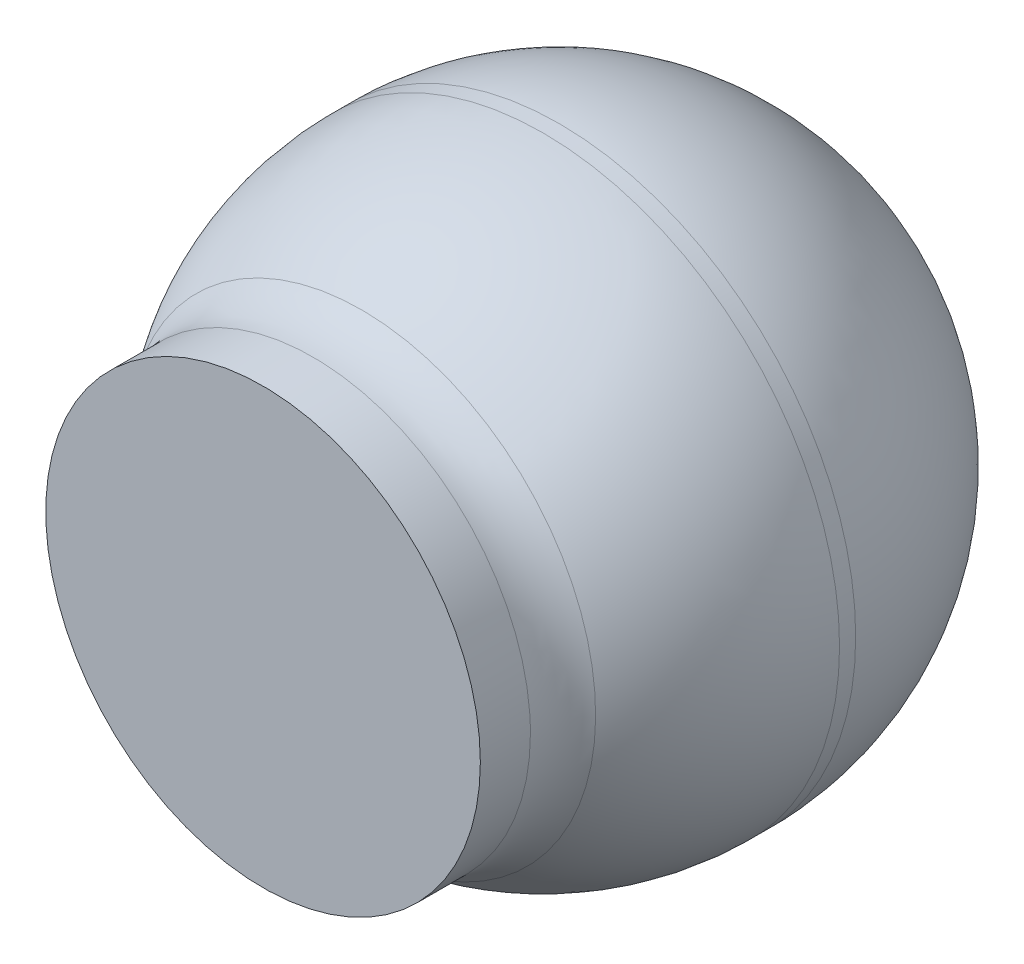
ISO-10303-21;
HEADER;
FILE_DESCRIPTION(('STEP AP214'),'2;1');
FILE_NAME('part.step','',(''),(''),'','','');
FILE_SCHEMA(('AUTOMOTIVE_DESIGN { 1 0 10303 214 1 1 1 1 }'));
ENDSEC;
DATA;
#1=APPLICATION_CONTEXT('core data for automotive mechanical design processes');
#2=APPLICATION_PROTOCOL_DEFINITION('international standard','automotive_design',2000,#1);
#3=PRODUCT_CONTEXT('',#1,'mechanical');
#4=PRODUCT('Part','Part','',(#3));
#5=PRODUCT_RELATED_PRODUCT_CATEGORY('part','',(#4));
#6=PRODUCT_DEFINITION_FORMATION('','',#4);
#7=PRODUCT_DEFINITION_CONTEXT('part definition',#1,'design');
#8=PRODUCT_DEFINITION('design','',#6,#7);
#9=PRODUCT_DEFINITION_SHAPE('','',#8);
#10=(LENGTH_UNIT() NAMED_UNIT(*) SI_UNIT(.MILLI.,.METRE.));
#11=(NAMED_UNIT(*) PLANE_ANGLE_UNIT() SI_UNIT($,.RADIAN.));
#12=(NAMED_UNIT(*) SI_UNIT($,.STERADIAN.) SOLID_ANGLE_UNIT());
#13=UNCERTAINTY_MEASURE_WITH_UNIT(LENGTH_MEASURE(1.E-05),#10,'distance_accuracy_value','');
#14=(GEOMETRIC_REPRESENTATION_CONTEXT(3) GLOBAL_UNCERTAINTY_ASSIGNED_CONTEXT((#13)) GLOBAL_UNIT_ASSIGNED_CONTEXT((#10,
#11,#12)) REPRESENTATION_CONTEXT('',''));
#15=CARTESIAN_POINT('',(0.,0.,0.));
#16=DIRECTION('',(0.,0.,1.));
#17=DIRECTION('',(1.,0.,0.));
#18=AXIS2_PLACEMENT_3D('',#15,#16,#17);
#19=CARTESIAN_POINT('',(-4.372919922269,-5.321349291452,10.006534503384));
#20=DIRECTION('',(0.,0.,-1.));
#21=DIRECTION('',(-1.,0.,0.));
#22=AXIS2_PLACEMENT_3D('',#19,#20,#21);
#23=PLANE('',#22);
#24=CARTESIAN_POINT('',(-4.372919922269,-5.321349291452,10.006534503384));
#25=DIRECTION('',(0.,0.,1.));
#26=DIRECTION('',(1.,0.,0.));
#27=AXIS2_PLACEMENT_3D('',#24,#25,#26);
#28=CIRCLE('',#27,0.275);
#29=CARTESIAN_POINT('',(-4.097919922269,-5.321349291452,10.006534503384));
#30=VERTEX_POINT('',#29);
#31=EDGE_CURVE('E20',#30,#30,#28,.F.);
#32=ORIENTED_EDGE('',*,*,#31,.F.);
#33=EDGE_LOOP('',(#32));
#34=FACE_BOUND('',#33,.T.);
#35=ADVANCED_FACE('F17',(#34),#23,.F.);
#36=CARTESIAN_POINT('',(-4.372919922269,-5.321349291452,9.906534503384));
#37=DIRECTION('',(0.,0.,1.));
#38=DIRECTION('',(1.,0.,0.));
#39=AXIS2_PLACEMENT_3D('',#36,#37,#38);
#40=CYLINDRICAL_SURFACE('',#39,0.275);
#41=CARTESIAN_POINT('',(-4.372919922269,-5.321349291452,9.943180457728));
#42=DIRECTION('',(0.,0.,-1.));
#43=DIRECTION('',(0.996700902337583,0.0811622527992439,0.));
#44=AXIS2_PLACEMENT_3D('',#41,#42,#43);
#45=CIRCLE('',#44,0.275);
#46=CARTESIAN_POINT('',(-4.09882717412617,-5.29902967193221,9.943180457728));
#47=VERTEX_POINT('',#46);
#48=EDGE_CURVE('E65',#47,#47,#45,.F.);
#49=ORIENTED_EDGE('',*,*,#48,.T.);
#50=EDGE_LOOP('',(#49));
#51=FACE_BOUND('',#50,.T.);
#52=ORIENTED_EDGE('',*,*,#31,.T.);
#53=EDGE_LOOP('',(#52));
#54=FACE_BOUND('',#53,.T.);
#55=ADVANCED_FACE('F62',(#51,#54),#40,.T.);
#56=CARTESIAN_POINT('',(-4.372919922269,-5.321349291452,9.943180457728));
#57=DIRECTION('',(0.,0.,-1.));
#58=DIRECTION('',(0.996700902337583,0.0811622527992448,0.));
#59=AXIS2_PLACEMENT_3D('',#56,#57,#58);
#60=TOROIDAL_SURFACE('',#59,0.375,0.1);
#61=ORIENTED_EDGE('',*,*,#48,.F.);
#62=EDGE_LOOP('',(#61));
#63=FACE_BOUND('',#62,.T.);
#64=CARTESIAN_POINT('',(-4.372919922269,-5.321349291452,9.881744931236));
#65=DIRECTION('',(0.,0.,-1.));
#66=DIRECTION('',(-0.996700902337598,-0.0811622527990622,0.));
#67=AXIS2_PLACEMENT_3D('',#64,#65,#66);
#68=CIRCLE('',#67,0.296097046412665);
#69=CARTESIAN_POINT('',(-4.668040115608,-5.345381194786,9.881744931236));
#70=VERTEX_POINT('',#69);
#71=EDGE_CURVE('E39',#70,#70,#68,.T.);
#72=ORIENTED_EDGE('',*,*,#71,.F.);
#73=EDGE_LOOP('',(#72));
#74=FACE_BOUND('',#73,.T.);
#75=ADVANCED_FACE('F57',(#63,#74),#60,.F.);
#76=CARTESIAN_POINT('',(-4.746682760645,-5.351785136252,9.651976062157));
#77=CARTESIAN_POINT('',(-4.746682760645,-5.351785136252,9.701461392103));
#78=CARTESIAN_POINT('',(-4.738526217348,-5.351120941579,9.750947004335));
#79=CARTESIAN_POINT('',(-4.722207085349,-5.349792059952,9.798626332798));
#80=CARTESIAN_POINT('',(-4.698341390838,-5.347848654938,9.842699544317));
#81=CARTESIAN_POINT('',(-4.668040115608,-5.345381194786,9.881744931236));
#82=(BOUNDED_CURVE() B_SPLINE_CURVE(5,(#76,#77,#78,#79,#80,#81),.UNSPECIFIED.,.F.,
.F.) B_SPLINE_CURVE_WITH_KNOTS((6,6),(0.,0.661568582165),
.UNSPECIFIED.) CURVE() GEOMETRIC_REPRESENTATION_ITEM() RATIONAL_B_SPLINE_CURVE((1.,1.,1.,1.,1.,1.)) REPRESENTATION_ITEM(''));
#83=CARTESIAN_POINT('',(-4.372919922269,-5.321349291452,9.651976062157));
#84=DIRECTION('',(0.,0.,-1.));
#85=AXIS1_PLACEMENT('',#83,#84);
#86=SURFACE_OF_REVOLUTION('',#82,#85);
#87=CARTESIAN_POINT('',(-4.372919922269,-5.321349291452,9.651976062157));
#88=DIRECTION('',(0.,0.,1.));
#89=DIRECTION('',(1.,0.,0.));
#90=AXIS2_PLACEMENT_3D('',#87,#88,#89);
#91=CIRCLE('',#90,0.375);
#92=CARTESIAN_POINT('',(-3.997919922269,-5.321349291452,9.651976062157));
#93=VERTEX_POINT('',#92);
#94=EDGE_CURVE('E36',#93,#93,#91,.F.);
#95=ORIENTED_EDGE('',*,*,#94,.F.);
#96=EDGE_LOOP('',(#95));
#97=FACE_BOUND('',#96,.T.);
#98=ORIENTED_EDGE('',*,*,#71,.T.);
#99=EDGE_LOOP('',(#98));
#100=FACE_BOUND('',#99,.T.);
#101=ADVANCED_FACE('F53',(#97,#100),#86,.F.);
#102=CARTESIAN_POINT('',(-4.372919922269,-5.321349291452,9.256534503384));
#103=DIRECTION('',(0.,0.,1.));
#104=DIRECTION('',(1.,0.,0.));
#105=AXIS2_PLACEMENT_3D('',#102,#103,#104);
#106=CYLINDRICAL_SURFACE('',#105,0.375);
#107=CARTESIAN_POINT('',(-4.372919922269,-5.321349291452,9.631534503384));
#108=DIRECTION('',(0.,0.,-1.));
#109=DIRECTION('',(0.0811622527992357,-0.996700902337583,0.));
#110=AXIS2_PLACEMENT_3D('',#107,#108,#109);
#111=CIRCLE('',#110,0.375);
#112=CARTESIAN_POINT('',(-4.34248407746929,-5.69511212982859,9.631534503384));
#113=VERTEX_POINT('',#112);
#114=CARTESIAN_POINT('',(-4.40335576706871,-4.94758645307541,9.631534503384));
#115=VERTEX_POINT('',#114);
#116=EDGE_CURVE('E11',#113,#115,#111,.T.);
#117=ORIENTED_EDGE('',*,*,#116,.F.);
#118=CARTESIAN_POINT('',(-4.372919922269,-5.321349291452,9.631534503384));
#119=DIRECTION('',(0.,0.,1.));
#120=DIRECTION('',(0.0811622527992365,-0.996700902337583,0.));
#121=AXIS2_PLACEMENT_3D('',#118,#119,#120);
#122=CIRCLE('',#121,0.375);
#123=EDGE_CURVE('E25',#115,#113,#122,.F.);
#124=ORIENTED_EDGE('',*,*,#123,.F.);
#125=EDGE_LOOP('',(#117,#124));
#126=FACE_BOUND('',#125,.T.);
#127=ORIENTED_EDGE('',*,*,#94,.T.);
#128=EDGE_LOOP('',(#127));
#129=FACE_BOUND('',#128,.T.);
#130=ADVANCED_FACE('F34',(#126,#129),#106,.T.);
#131=CARTESIAN_POINT('',(-4.372919922269,-5.321349291452,9.631534503384));
#132=DIRECTION('',(0.0811622527992361,-0.996700902337583,0.));
#133=DIRECTION('',(-0.996700902337583,-0.0811622527992361,0.));
#134=AXIS2_PLACEMENT_3D('',#131,#132,#133);
#135=SPHERICAL_SURFACE('',#134,0.375);
#136=ORIENTED_EDGE('',*,*,#123,.T.);
#137=ORIENTED_EDGE('',*,*,#116,.T.);
#138=EDGE_LOOP('',(#136,#137));
#139=FACE_BOUND('',#138,.T.);
#140=ADVANCED_FACE('F32',(#139),#135,.T.);
#141=CLOSED_SHELL('',(#35,#55,#75,#101,#130,#140));
#142=MANIFOLD_SOLID_BREP('B1',#141);
#143=ADVANCED_BREP_SHAPE_REPRESENTATION('',(#18,#142),#14);
#144=SHAPE_DEFINITION_REPRESENTATION(#9,#143);
ENDSEC;
END-ISO-10303-21;
